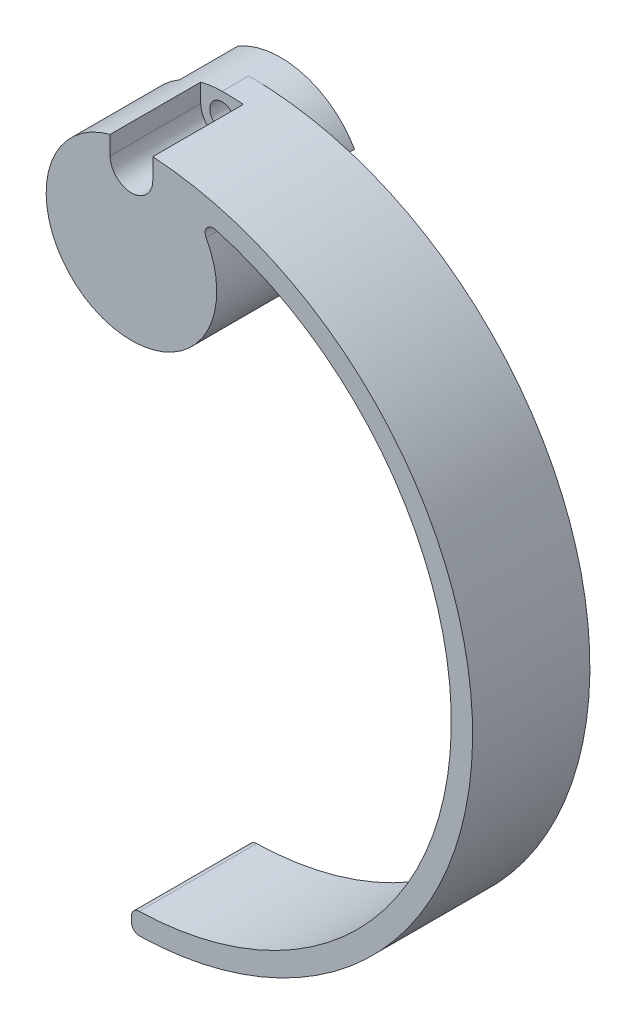
ISO-10303-21;
HEADER;
FILE_DESCRIPTION(('STEP AP214'),'2;1');
FILE_NAME('part.step','',(''),(''),'','','');
FILE_SCHEMA(('AUTOMOTIVE_DESIGN { 1 0 10303 214 1 1 1 1 }'));
ENDSEC;
DATA;
#1=APPLICATION_CONTEXT('core data for automotive mechanical design processes');
#2=APPLICATION_PROTOCOL_DEFINITION('international standard','automotive_design',2000,#1);
#3=PRODUCT_CONTEXT('',#1,'mechanical');
#4=PRODUCT('Part','Part','',(#3));
#5=PRODUCT_RELATED_PRODUCT_CATEGORY('part','',(#4));
#6=PRODUCT_DEFINITION_FORMATION('','',#4);
#7=PRODUCT_DEFINITION_CONTEXT('part definition',#1,'design');
#8=PRODUCT_DEFINITION('design','',#6,#7);
#9=PRODUCT_DEFINITION_SHAPE('','',#8);
#10=(LENGTH_UNIT() NAMED_UNIT(*) SI_UNIT(.MILLI.,.METRE.));
#11=(NAMED_UNIT(*) PLANE_ANGLE_UNIT() SI_UNIT($,.RADIAN.));
#12=(NAMED_UNIT(*) SI_UNIT($,.STERADIAN.) SOLID_ANGLE_UNIT());
#13=UNCERTAINTY_MEASURE_WITH_UNIT(LENGTH_MEASURE(1.E-05),#10,'distance_accuracy_value','');
#14=(GEOMETRIC_REPRESENTATION_CONTEXT(3) GLOBAL_UNCERTAINTY_ASSIGNED_CONTEXT((#13)) GLOBAL_UNIT_ASSIGNED_CONTEXT((#10,
#11,#12)) REPRESENTATION_CONTEXT('',''));
#15=CARTESIAN_POINT('',(0.,0.,0.));
#16=DIRECTION('',(0.,0.,1.));
#17=DIRECTION('',(1.,0.,0.));
#18=AXIS2_PLACEMENT_3D('',#15,#16,#17);
#19=CARTESIAN_POINT('',(0.,0.,11.));
#20=DIRECTION('',(0.,0.,-1.));
#21=DIRECTION('',(-1.,0.,0.));
#22=AXIS2_PLACEMENT_3D('',#19,#20,#21);
#23=CYLINDRICAL_SURFACE('',#22,8.);
#24=CARTESIAN_POINT('',(0.,0.,0.));
#25=DIRECTION('',(0.,0.,-1.));
#26=DIRECTION('',(-1.,0.,0.));
#27=AXIS2_PLACEMENT_3D('',#24,#25,#26);
#28=CIRCLE('',#27,8.);
#29=CARTESIAN_POINT('',(0.,8.,0.));
#30=VERTEX_POINT('',#29);
#31=CARTESIAN_POINT('',(6.92820323027549,4.00000000000003,0.));
#32=VERTEX_POINT('',#31);
#33=EDGE_CURVE('E368',#30,#32,#28,.T.);
#34=ORIENTED_EDGE('',*,*,#33,.T.);
#35=DIRECTION('',(0.,0.,-1.));
#36=VECTOR('',#35,1.);
#37=CARTESIAN_POINT('',(6.92820323027549,4.00000000000003,24.3826701223687));
#38=LINE('',#37,#36);
#39=CARTESIAN_POINT('',(6.92820323027549,4.00000000000003,-3.));
#40=VERTEX_POINT('',#39);
#41=EDGE_CURVE('E252',#32,#40,#38,.T.);
#42=ORIENTED_EDGE('',*,*,#41,.T.);
#43=CARTESIAN_POINT('',(0.,0.,-3.));
#44=DIRECTION('',(0.,0.,-1.));
#45=DIRECTION('',(-1.,0.,0.));
#46=AXIS2_PLACEMENT_3D('',#43,#44,#45);
#47=CIRCLE('',#46,8.);
#48=CARTESIAN_POINT('',(-4.00000000000001,6.92820323027551,-3.));
#49=VERTEX_POINT('',#48);
#50=EDGE_CURVE('E269',#49,#40,#47,.T.);
#51=ORIENTED_EDGE('',*,*,#50,.F.);
#52=DIRECTION('',(0.,0.,-1.));
#53=VECTOR('',#52,1.);
#54=CARTESIAN_POINT('',(-4.00000000000001,6.92820323027551,24.3826701223687));
#55=LINE('',#54,#53);
#56=CARTESIAN_POINT('',(-4.00000000000001,6.92820323027551,2.5));
#57=VERTEX_POINT('',#56);
#58=EDGE_CURVE('E296',#57,#49,#55,.T.);
#59=ORIENTED_EDGE('',*,*,#58,.F.);
#60=CARTESIAN_POINT('',(0.,0.,2.5));
#61=DIRECTION('',(0.,0.,-1.));
#62=DIRECTION('',(-1.,0.,0.));
#63=AXIS2_PLACEMENT_3D('',#60,#61,#62);
#64=CIRCLE('',#63,8.);
#65=CARTESIAN_POINT('',(-7.74596669241484,2.,2.5));
#66=VERTEX_POINT('',#65);
#67=EDGE_CURVE('E497',#57,#66,#64,.F.);
#68=ORIENTED_EDGE('',*,*,#67,.T.);
#69=DIRECTION('',(0.,0.,-1.));
#70=VECTOR('',#69,1.);
#71=CARTESIAN_POINT('',(-7.74596669241485,2.,11.));
#72=LINE('',#71,#70);
#73=CARTESIAN_POINT('',(-7.74596669241485,2.,5.));
#74=VERTEX_POINT('',#73);
#75=EDGE_CURVE('E407',#66,#74,#72,.F.);
#76=ORIENTED_EDGE('',*,*,#75,.T.);
#77=CARTESIAN_POINT('',(0.,0.,5.));
#78=DIRECTION('',(0.,0.,-1.));
#79=DIRECTION('',(-1.,0.,0.));
#80=AXIS2_PLACEMENT_3D('',#77,#78,#79);
#81=CIRCLE('',#80,8.00000000000001);
#82=CARTESIAN_POINT('',(-7.74596669241484,-2.,5.));
#83=VERTEX_POINT('',#82);
#84=EDGE_CURVE('E547',#74,#83,#81,.F.);
#85=ORIENTED_EDGE('',*,*,#84,.T.);
#86=DIRECTION('',(0.,0.,-1.));
#87=VECTOR('',#86,1.);
#88=CARTESIAN_POINT('',(-7.74596669241484,-2.,11.));
#89=LINE('',#88,#87);
#90=CARTESIAN_POINT('',(-7.74596669241483,-2.,2.5));
#91=VERTEX_POINT('',#90);
#92=EDGE_CURVE('E405',#83,#91,#89,.T.);
#93=ORIENTED_EDGE('',*,*,#92,.T.);
#94=CARTESIAN_POINT('',(-2.,-7.74596669241483,2.5));
#95=VERTEX_POINT('',#94);
#96=EDGE_CURVE('E499',#91,#95,#64,.F.);
#97=ORIENTED_EDGE('',*,*,#96,.T.);
#98=DIRECTION('',(0.,0.,-1.));
#99=VECTOR('',#98,1.);
#100=CARTESIAN_POINT('',(-2.,-7.74596669241484,11.));
#101=LINE('',#100,#99);
#102=CARTESIAN_POINT('',(-2.,-7.74596669241484,5.));
#103=VERTEX_POINT('',#102);
#104=EDGE_CURVE('E402',#95,#103,#101,.F.);
#105=ORIENTED_EDGE('',*,*,#104,.T.);
#106=CARTESIAN_POINT('',(2.,-7.74596669241483,5.));
#107=VERTEX_POINT('',#106);
#108=EDGE_CURVE('E545',#103,#107,#81,.F.);
#109=ORIENTED_EDGE('',*,*,#108,.T.);
#110=DIRECTION('',(0.,0.,-1.));
#111=VECTOR('',#110,1.);
#112=CARTESIAN_POINT('',(2.,-7.74596669241483,11.));
#113=LINE('',#112,#111);
#114=CARTESIAN_POINT('',(2.,-7.74596669241483,2.5));
#115=VERTEX_POINT('',#114);
#116=EDGE_CURVE('E400',#107,#115,#113,.T.);
#117=ORIENTED_EDGE('',*,*,#116,.T.);
#118=CARTESIAN_POINT('',(7.74596669241483,-2.,2.5));
#119=VERTEX_POINT('',#118);
#120=EDGE_CURVE('E495',#115,#119,#64,.F.);
#121=ORIENTED_EDGE('',*,*,#120,.T.);
#122=DIRECTION('',(0.,0.,-1.));
#123=VECTOR('',#122,1.);
#124=CARTESIAN_POINT('',(7.74596669241483,-2.,11.));
#125=LINE('',#124,#123);
#126=CARTESIAN_POINT('',(7.74596669241483,-2.,5.));
#127=VERTEX_POINT('',#126);
#128=EDGE_CURVE('E397',#119,#127,#125,.F.);
#129=ORIENTED_EDGE('',*,*,#128,.T.);
#130=CARTESIAN_POINT('',(7.74596669241483,2.,5.));
#131=VERTEX_POINT('',#130);
#132=EDGE_CURVE('E541',#127,#131,#81,.F.);
#133=ORIENTED_EDGE('',*,*,#132,.T.);
#134=DIRECTION('',(0.,0.,-1.));
#135=VECTOR('',#134,1.);
#136=CARTESIAN_POINT('',(7.74596669241483,2.,11.));
#137=LINE('',#136,#135);
#138=CARTESIAN_POINT('',(7.74596669241483,2.,2.5));
#139=VERTEX_POINT('',#138);
#140=EDGE_CURVE('E393',#131,#139,#137,.T.);
#141=ORIENTED_EDGE('',*,*,#140,.T.);
#142=CARTESIAN_POINT('',(7.00349119289008,3.86666666666667,2.5));
#143=VERTEX_POINT('',#142);
#144=EDGE_CURVE('E287',#139,#143,#64,.F.);
#145=ORIENTED_EDGE('',*,*,#144,.T.);
#146=DIRECTION('',(0.,0.,-1.));
#147=VECTOR('',#146,1.);
#148=CARTESIAN_POINT('',(7.00349119289008,3.86666666666667,11.));
#149=LINE('',#148,#147);
#150=CARTESIAN_POINT('',(7.00349119289008,3.86666666666667,11.));
#151=VERTEX_POINT('',#150);
#152=EDGE_CURVE('E423',#143,#151,#149,.F.);
#153=ORIENTED_EDGE('',*,*,#152,.T.);
#154=CARTESIAN_POINT('',(0.,0.,11.));
#155=DIRECTION('',(0.,0.,1.));
#156=DIRECTION('',(1.,0.,0.));
#157=AXIS2_PLACEMENT_3D('',#154,#155,#156);
#158=CIRCLE('',#157,8.);
#159=CARTESIAN_POINT('',(-2.,7.74596669241484,11.));
#160=VERTEX_POINT('',#159);
#161=EDGE_CURVE('E374',#160,#151,#158,.T.);
#162=ORIENTED_EDGE('',*,*,#161,.F.);
#163=DIRECTION('',(0.,0.,-1.));
#164=VECTOR('',#163,1.);
#165=CARTESIAN_POINT('',(-2.,7.74596669241484,11.));
#166=LINE('',#165,#164);
#167=CARTESIAN_POINT('',(-2.,7.74596669241484,2.5));
#168=VERTEX_POINT('',#167);
#169=EDGE_CURVE('E410',#160,#168,#166,.T.);
#170=ORIENTED_EDGE('',*,*,#169,.T.);
#171=CARTESIAN_POINT('',(0.,0.,2.5));
#172=DIRECTION('',(0.,0.,-1.));
#173=DIRECTION('',(-1.,0.,0.));
#174=AXIS2_PLACEMENT_3D('',#171,#172,#173);
#175=CIRCLE('',#174,8.);
#176=CARTESIAN_POINT('',(0.,8.,2.5));
#177=VERTEX_POINT('',#176);
#178=EDGE_CURVE('E359',#168,#177,#175,.T.);
#179=ORIENTED_EDGE('',*,*,#178,.T.);
#180=DIRECTION('',(0.,0.,-1.));
#181=VECTOR('',#180,1.);
#182=CARTESIAN_POINT('',(0.,8.,11.));
#183=LINE('',#182,#181);
#184=EDGE_CURVE('E384',#177,#30,#183,.T.);
#185=ORIENTED_EDGE('',*,*,#184,.T.);
#186=EDGE_LOOP('',(#34,#42,#51,#59,#68,#76,#85,#93,#97,#105,#109,#117,#121,#129,#133,#141,#145,
#153,#162,#170,#179,#185));
#187=FACE_BOUND('',#186,.T.);
#188=ADVANCED_FACE('F35',(#187),#23,.T.);
#189=CARTESIAN_POINT('',(0.,-24.,11.));
#190=DIRECTION('',(0.,0.,-1.));
#191=DIRECTION('',(-1.,0.,0.));
#192=AXIS2_PLACEMENT_3D('',#189,#190,#191);
#193=PLANE('',#192);
#194=DIRECTION('',(0.,-1.,0.));
#195=VECTOR('',#194,1.);
#196=CARTESIAN_POINT('',(0.,-56.,11.));
#197=LINE('',#196,#195);
#198=CARTESIAN_POINT('',(0.,-54.7408522978788,11.));
#199=VERTEX_POINT('',#198);
#200=CARTESIAN_POINT('',(0.,-55.2409987036266,11.));
#201=VERTEX_POINT('',#200);
#202=EDGE_CURVE('E381',#199,#201,#197,.T.);
#203=ORIENTED_EDGE('',*,*,#202,.T.);
#204=CARTESIAN_POINT('',(0.75,-55.2409987036266,11.));
#205=DIRECTION('',(0.,0.,-1.));
#206=DIRECTION('',(-1.,0.,0.));
#207=AXIS2_PLACEMENT_3D('',#204,#205,#206);
#208=CIRCLE('',#207,0.75);
#209=CARTESIAN_POINT('',(0.768,-55.9907826725137,11.));
#210=VERTEX_POINT('',#209);
#211=EDGE_CURVE('E439',#201,#210,#208,.F.);
#212=ORIENTED_EDGE('',*,*,#211,.T.);
#213=CARTESIAN_POINT('',(0.,-24.,11.));
#214=DIRECTION('',(0.,0.,1.));
#215=DIRECTION('',(-1.,0.,0.));
#216=AXIS2_PLACEMENT_3D('',#213,#214,#215);
#217=CIRCLE('',#216,32.);
#218=CARTESIAN_POINT('',(2.,7.93743884534262,11.));
#219=VERTEX_POINT('',#218);
#220=EDGE_CURVE('E372',#210,#219,#217,.T.);
#221=ORIENTED_EDGE('',*,*,#220,.T.);
#222=DIRECTION('',(0.,1.,0.));
#223=VECTOR('',#222,1.);
#224=CARTESIAN_POINT('',(2.,8.,11.));
#225=LINE('',#224,#223);
#226=CARTESIAN_POINT('',(2.,6.,11.));
#227=VERTEX_POINT('',#226);
#228=EDGE_CURVE('E305',#227,#219,#225,.T.);
#229=ORIENTED_EDGE('',*,*,#228,.F.);
#230=CARTESIAN_POINT('',(0.,6.,11.));
#231=DIRECTION('',(0.,0.,1.));
#232=DIRECTION('',(-1.,0.,0.));
#233=AXIS2_PLACEMENT_3D('',#230,#231,#232);
#234=CIRCLE('',#233,2.);
#235=CARTESIAN_POINT('',(-2.,6.,11.));
#236=VERTEX_POINT('',#235);
#237=EDGE_CURVE('E308',#236,#227,#234,.T.);
#238=ORIENTED_EDGE('',*,*,#237,.F.);
#239=DIRECTION('',(0.,-1.,0.));
#240=VECTOR('',#239,1.);
#241=CARTESIAN_POINT('',(-2.,6.,11.));
#242=LINE('',#241,#240);
#243=EDGE_CURVE('E302',#160,#236,#242,.T.);
#244=ORIENTED_EDGE('',*,*,#243,.F.);
#245=ORIENTED_EDGE('',*,*,#161,.T.);
#246=CARTESIAN_POINT('',(7.66006849222352,4.22916666666667,11.));
#247=DIRECTION('',(0.,0.,-1.));
#248=DIRECTION('',(-1.,0.,0.));
#249=AXIS2_PLACEMENT_3D('',#246,#247,#248);
#250=CIRCLE('',#249,0.75);
#251=CARTESIAN_POINT('',(7.85648050484463,4.95299145299145,11.));
#252=VERTEX_POINT('',#251);
#253=EDGE_CURVE('E43',#151,#252,#250,.T.);
#254=ORIENTED_EDGE('',*,*,#253,.T.);
#255=CARTESIAN_POINT('',(0.,-24.,11.));
#256=DIRECTION('',(0.,0.,-1.));
#257=DIRECTION('',(-1.,0.,0.));
#258=AXIS2_PLACEMENT_3D('',#255,#256,#257);
#259=CIRCLE('',#258,30.);
#260=CARTESIAN_POINT('',(0.731707317073171,-53.9910754125647,11.));
#261=VERTEX_POINT('',#260);
#262=EDGE_CURVE('E378',#252,#261,#259,.T.);
#263=ORIENTED_EDGE('',*,*,#262,.T.);
#264=CARTESIAN_POINT('',(0.75,-54.7408522978788,11.));
#265=DIRECTION('',(0.,0.,-1.));
#266=DIRECTION('',(-1.,0.,0.));
#267=AXIS2_PLACEMENT_3D('',#264,#265,#266);
#268=CIRCLE('',#267,0.75);
#269=EDGE_CURVE('E437',#261,#199,#268,.F.);
#270=ORIENTED_EDGE('',*,*,#269,.T.);
#271=EDGE_LOOP('',(#203,#212,#221,#229,#238,#244,#245,#254,#263,#270));
#272=FACE_BOUND('',#271,.T.);
#273=ADVANCED_FACE('F448',(#272),#193,.F.);
#274=CARTESIAN_POINT('',(0.,-24.,0.));
#275=DIRECTION('',(0.,0.,-1.));
#276=DIRECTION('',(-1.,0.,0.));
#277=AXIS2_PLACEMENT_3D('',#274,#275,#276);
#278=PLANE('',#277);
#279=CARTESIAN_POINT('',(0.,-24.,0.));
#280=DIRECTION('',(0.,0.,1.));
#281=DIRECTION('',(-1.,0.,0.));
#282=AXIS2_PLACEMENT_3D('',#279,#280,#281);
#283=CIRCLE('',#282,32.);
#284=CARTESIAN_POINT('',(0.768,-55.9907826725137,0.));
#285=VERTEX_POINT('',#284);
#286=EDGE_CURVE('E370',#285,#30,#283,.T.);
#287=ORIENTED_EDGE('',*,*,#286,.F.);
#288=CARTESIAN_POINT('',(0.75,-55.2409987036266,0.));
#289=DIRECTION('',(0.,0.,-1.));
#290=DIRECTION('',(-1.,0.,0.));
#291=AXIS2_PLACEMENT_3D('',#288,#289,#290);
#292=CIRCLE('',#291,0.75);
#293=CARTESIAN_POINT('',(0.,-55.2409987036266,0.));
#294=VERTEX_POINT('',#293);
#295=EDGE_CURVE('E430',#285,#294,#292,.T.);
#296=ORIENTED_EDGE('',*,*,#295,.T.);
#297=DIRECTION('',(0.,-1.,0.));
#298=VECTOR('',#297,1.);
#299=CARTESIAN_POINT('',(0.,-56.,0.));
#300=LINE('',#299,#298);
#301=CARTESIAN_POINT('',(0.,-54.7408522978788,0.));
#302=VERTEX_POINT('',#301);
#303=EDGE_CURVE('E375',#302,#294,#300,.T.);
#304=ORIENTED_EDGE('',*,*,#303,.F.);
#305=CARTESIAN_POINT('',(0.75,-54.7408522978788,0.));
#306=DIRECTION('',(0.,0.,-1.));
#307=DIRECTION('',(-1.,0.,0.));
#308=AXIS2_PLACEMENT_3D('',#305,#306,#307);
#309=CIRCLE('',#308,0.75);
#310=CARTESIAN_POINT('',(0.731707317073171,-53.9910754125647,0.));
#311=VERTEX_POINT('',#310);
#312=EDGE_CURVE('E428',#302,#311,#309,.T.);
#313=ORIENTED_EDGE('',*,*,#312,.T.);
#314=CARTESIAN_POINT('',(0.,-24.,0.));
#315=DIRECTION('',(0.,0.,-1.));
#316=DIRECTION('',(-1.,0.,0.));
#317=AXIS2_PLACEMENT_3D('',#314,#315,#316);
#318=CIRCLE('',#317,30.);
#319=CARTESIAN_POINT('',(7.85648050484463,4.95299145299145,0.));
#320=VERTEX_POINT('',#319);
#321=EDGE_CURVE('E386',#320,#311,#318,.T.);
#322=ORIENTED_EDGE('',*,*,#321,.F.);
#323=CARTESIAN_POINT('',(7.66006849222352,4.22916666666667,0.));
#324=DIRECTION('',(0.,0.,-1.));
#325=DIRECTION('',(-1.,0.,0.));
#326=AXIS2_PLACEMENT_3D('',#323,#324,#325);
#327=CIRCLE('',#326,0.75);
#328=CARTESIAN_POINT('',(6.94321441395881,4.00866671094045,0.));
#329=VERTEX_POINT('',#328);
#330=EDGE_CURVE('E50',#320,#329,#327,.F.);
#331=ORIENTED_EDGE('',*,*,#330,.T.);
#332=DIRECTION('',(0.866025403784436,0.500000000000004,0.));
#333=VECTOR('',#332,1.);
#334=CARTESIAN_POINT('',(-10.3923048454133,-6.0000000000001,0.));
#335=LINE('',#334,#333);
#336=EDGE_CURVE('E12',#32,#329,#335,.T.);
#337=ORIENTED_EDGE('',*,*,#336,.F.);
#338=ORIENTED_EDGE('',*,*,#33,.F.);
#339=EDGE_LOOP('',(#287,#296,#304,#313,#322,#331,#337,#338));
#340=FACE_BOUND('',#339,.T.);
#341=ADVANCED_FACE('F463',(#340),#278,.T.);
#342=CARTESIAN_POINT('',(0.,-24.,11.));
#343=DIRECTION('',(0.,0.,-1.));
#344=DIRECTION('',(-1.,0.,0.));
#345=AXIS2_PLACEMENT_3D('',#342,#343,#344);
#346=CYLINDRICAL_SURFACE('',#345,32.);
#347=ORIENTED_EDGE('',*,*,#220,.F.);
#348=DIRECTION('',(0.,0.,-1.));
#349=VECTOR('',#348,1.);
#350=CARTESIAN_POINT('',(0.768,-55.9907826725137,11.));
#351=LINE('',#350,#349);
#352=EDGE_CURVE('E425',#210,#285,#351,.T.);
#353=ORIENTED_EDGE('',*,*,#352,.T.);
#354=ORIENTED_EDGE('',*,*,#286,.T.);
#355=ORIENTED_EDGE('',*,*,#184,.F.);
#356=CARTESIAN_POINT('',(0.,-24.,2.5));
#357=DIRECTION('',(0.,0.,-1.));
#358=DIRECTION('',(-1.,0.,0.));
#359=AXIS2_PLACEMENT_3D('',#356,#357,#358);
#360=CIRCLE('',#359,32.);
#361=CARTESIAN_POINT('',(2.,7.93743884534262,2.5));
#362=VERTEX_POINT('',#361);
#363=EDGE_CURVE('E362',#177,#362,#360,.T.);
#364=ORIENTED_EDGE('',*,*,#363,.T.);
#365=DIRECTION('',(0.,0.,-1.));
#366=VECTOR('',#365,1.);
#367=CARTESIAN_POINT('',(2.,7.93743884534262,11.));
#368=LINE('',#367,#366);
#369=EDGE_CURVE('E413',#362,#219,#368,.F.);
#370=ORIENTED_EDGE('',*,*,#369,.T.);
#371=EDGE_LOOP('',(#347,#353,#354,#355,#364,#370));
#372=FACE_BOUND('',#371,.T.);
#373=ADVANCED_FACE('F469',(#372),#346,.T.);
#374=CARTESIAN_POINT('',(0.,-24.,11.));
#375=DIRECTION('',(0.,0.,-1.));
#376=DIRECTION('',(-1.,0.,0.));
#377=AXIS2_PLACEMENT_3D('',#374,#375,#376);
#378=CYLINDRICAL_SURFACE('',#377,30.);
#379=ORIENTED_EDGE('',*,*,#262,.F.);
#380=DIRECTION('',(0.,0.,-1.));
#381=VECTOR('',#380,1.);
#382=CARTESIAN_POINT('',(7.85648050484463,4.95299145299145,11.));
#383=LINE('',#382,#381);
#384=EDGE_CURVE('E420',#252,#320,#383,.T.);
#385=ORIENTED_EDGE('',*,*,#384,.T.);
#386=ORIENTED_EDGE('',*,*,#321,.T.);
#387=DIRECTION('',(0.,0.,-1.));
#388=VECTOR('',#387,1.);
#389=CARTESIAN_POINT('',(0.731707317073171,-53.9910754125647,11.));
#390=LINE('',#389,#388);
#391=EDGE_CURVE('E418',#311,#261,#390,.F.);
#392=ORIENTED_EDGE('',*,*,#391,.T.);
#393=EDGE_LOOP('',(#379,#385,#386,#392));
#394=FACE_BOUND('',#393,.T.);
#395=ADVANCED_FACE('F456',(#394),#378,.F.);
#396=CARTESIAN_POINT('',(0.,-56.,11.));
#397=DIRECTION('',(1.,0.,0.));
#398=DIRECTION('',(0.,0.,-1.));
#399=AXIS2_PLACEMENT_3D('',#396,#397,#398);
#400=PLANE('',#399);
#401=ORIENTED_EDGE('',*,*,#303,.T.);
#402=DIRECTION('',(0.,0.,-1.));
#403=VECTOR('',#402,1.);
#404=CARTESIAN_POINT('',(0.,-55.2409987036266,11.));
#405=LINE('',#404,#403);
#406=EDGE_CURVE('E435',#294,#201,#405,.F.);
#407=ORIENTED_EDGE('',*,*,#406,.T.);
#408=ORIENTED_EDGE('',*,*,#202,.F.);
#409=DIRECTION('',(0.,0.,-1.));
#410=VECTOR('',#409,1.);
#411=CARTESIAN_POINT('',(0.,-54.7408522978788,11.));
#412=LINE('',#411,#410);
#413=EDGE_CURVE('E432',#199,#302,#412,.T.);
#414=ORIENTED_EDGE('',*,*,#413,.T.);
#415=EDGE_LOOP('',(#401,#407,#408,#414));
#416=FACE_BOUND('',#415,.T.);
#417=ADVANCED_FACE('F477',(#416),#400,.F.);
#418=CARTESIAN_POINT('',(0.,6.,11.));
#419=DIRECTION('',(0.,0.,-1.));
#420=DIRECTION('',(-1.,0.,0.));
#421=AXIS2_PLACEMENT_3D('',#418,#419,#420);
#422=CYLINDRICAL_SURFACE('',#421,1.15);
#423=CARTESIAN_POINT('',(0.,6.,2.5));
#424=DIRECTION('',(0.,0.,-1.));
#425=DIRECTION('',(-1.,0.,0.));
#426=AXIS2_PLACEMENT_3D('',#423,#424,#425);
#427=CIRCLE('',#426,1.15);
#428=CARTESIAN_POINT('',(-1.15,6.,2.5));
#429=VERTEX_POINT('',#428);
#430=EDGE_CURVE('E324',#429,#429,#427,.T.);
#431=ORIENTED_EDGE('',*,*,#430,.F.);
#432=EDGE_LOOP('',(#431));
#433=FACE_BOUND('',#432,.T.);
#434=CARTESIAN_POINT('',(0.,6.,-3.));
#435=DIRECTION('',(0.,0.,-1.));
#436=DIRECTION('',(-1.,0.,0.));
#437=AXIS2_PLACEMENT_3D('',#434,#435,#436);
#438=CIRCLE('',#437,1.15);
#439=CARTESIAN_POINT('',(-1.15,6.,-3.));
#440=VERTEX_POINT('',#439);
#441=EDGE_CURVE('E365',#440,#440,#438,.T.);
#442=ORIENTED_EDGE('',*,*,#441,.T.);
#443=EDGE_LOOP('',(#442));
#444=FACE_BOUND('',#443,.T.);
#445=ADVANCED_FACE('F641',(#433,#444),#422,.F.);
#446=CARTESIAN_POINT('',(0.,0.,-3.));
#447=DIRECTION('',(0.,0.,-1.));
#448=DIRECTION('',(-1.,0.,0.));
#449=AXIS2_PLACEMENT_3D('',#446,#447,#448);
#450=PLANE('',#449);
#451=DIRECTION('',(0.500000000000001,-0.866025403784438,0.));
#452=VECTOR('',#451,1.);
#453=CARTESIAN_POINT('',(-4.00000000000001,6.92820323027551,-3.));
#454=LINE('',#453,#452);
#455=CARTESIAN_POINT('',(-1.975,3.42080034494853,-3.));
#456=VERTEX_POINT('',#455);
#457=EDGE_CURVE('E270',#49,#456,#454,.T.);
#458=ORIENTED_EDGE('',*,*,#457,.F.);
#459=ORIENTED_EDGE('',*,*,#50,.T.);
#460=DIRECTION('',(0.866025403784436,0.500000000000004,0.));
#461=VECTOR('',#460,1.);
#462=CARTESIAN_POINT('',(3.42080034494852,1.97500000000002,-3.));
#463=LINE('',#462,#461);
#464=CARTESIAN_POINT('',(3.42080034494852,1.97500000000002,-3.));
#465=VERTEX_POINT('',#464);
#466=EDGE_CURVE('E249',#465,#40,#463,.T.);
#467=ORIENTED_EDGE('',*,*,#466,.F.);
#468=CARTESIAN_POINT('',(0.,0.,-3.));
#469=DIRECTION('',(0.,0.,1.));
#470=DIRECTION('',(-1.,0.,0.));
#471=AXIS2_PLACEMENT_3D('',#468,#469,#470);
#472=CIRCLE('',#471,3.95);
#473=CARTESIAN_POINT('',(-2.01721779919058,-3.39607602250431,-3.));
#474=VERTEX_POINT('',#473);
#475=EDGE_CURVE('E256',#474,#465,#472,.T.);
#476=ORIENTED_EDGE('',*,*,#475,.F.);
#477=DIRECTION('',(0.707106781186551,0.707106781186544,0.));
#478=VECTOR('',#477,1.);
#479=CARTESIAN_POINT('',(-2.01721779919058,-3.39607602250431,-3.));
#480=LINE('',#479,#478);
#481=CARTESIAN_POINT('',(-2.72432458037713,-4.10318280369086,-3.));
#482=VERTEX_POINT('',#481);
#483=EDGE_CURVE('E253',#482,#474,#480,.T.);
#484=ORIENTED_EDGE('',*,*,#483,.F.);
#485=DIRECTION('',(0.707106781186544,-0.707106781186551,0.));
#486=VECTOR('',#485,1.);
#487=CARTESIAN_POINT('',(-2.72432458037713,-4.10318280369086,-3.));
#488=LINE('',#487,#486);
#489=CARTESIAN_POINT('',(-4.10318280369089,-2.72432458037708,-3.));
#490=VERTEX_POINT('',#489);
#491=EDGE_CURVE('E282',#490,#482,#488,.T.);
#492=ORIENTED_EDGE('',*,*,#491,.F.);
#493=DIRECTION('',(-0.707106781186551,-0.707106781186544,0.));
#494=VECTOR('',#493,1.);
#495=CARTESIAN_POINT('',(-4.10318280369089,-2.72432458037708,-3.));
#496=LINE('',#495,#494);
#497=CARTESIAN_POINT('',(-3.39607602250434,-2.01721779919054,-3.));
#498=VERTEX_POINT('',#497);
#499=EDGE_CURVE('E279',#498,#490,#496,.T.);
#500=ORIENTED_EDGE('',*,*,#499,.F.);
#501=CARTESIAN_POINT('',(0.,0.,-3.));
#502=DIRECTION('',(0.,0.,1.));
#503=DIRECTION('',(-1.,0.,0.));
#504=AXIS2_PLACEMENT_3D('',#501,#502,#503);
#505=CIRCLE('',#504,3.95);
#506=EDGE_CURVE('E273',#456,#498,#505,.T.);
#507=ORIENTED_EDGE('',*,*,#506,.F.);
#508=EDGE_LOOP('',(#458,#459,#467,#476,#484,#492,#500,#507));
#509=FACE_BOUND('',#508,.T.);
#510=ORIENTED_EDGE('',*,*,#441,.F.);
#511=EDGE_LOOP('',(#510));
#512=FACE_BOUND('',#511,.T.);
#513=ADVANCED_FACE('F266',(#509,#512),#450,.T.);
#514=CARTESIAN_POINT('',(8.,-2.,-8.65685424949238));
#515=DIRECTION('',(0.,-1.,0.));
#516=DIRECTION('',(1.,0.,0.));
#517=AXIS2_PLACEMENT_3D('',#514,#515,#516);
#518=PLANE('',#517);
#519=DIRECTION('',(0.,0.,1.));
#520=VECTOR('',#519,1.);
#521=CARTESIAN_POINT('',(6.,-2.,-8.65685424949238));
#522=LINE('',#521,#520);
#523=CARTESIAN_POINT('',(6.,-2.,2.5));
#524=VERTEX_POINT('',#523);
#525=CARTESIAN_POINT('',(6.,-2.,5.));
#526=VERTEX_POINT('',#525);
#527=EDGE_CURVE('E340',#524,#526,#522,.T.);
#528=ORIENTED_EDGE('',*,*,#527,.T.);
#529=DIRECTION('',(1.,0.,0.));
#530=VECTOR('',#529,1.);
#531=CARTESIAN_POINT('',(8.,-2.,5.));
#532=LINE('',#531,#530);
#533=EDGE_CURVE('E263',#526,#127,#532,.T.);
#534=ORIENTED_EDGE('',*,*,#533,.T.);
#535=ORIENTED_EDGE('',*,*,#128,.F.);
#536=DIRECTION('',(1.,0.,0.));
#537=VECTOR('',#536,1.);
#538=CARTESIAN_POINT('',(8.,-2.,2.5));
#539=LINE('',#538,#537);
#540=EDGE_CURVE('E300',#524,#119,#539,.T.);
#541=ORIENTED_EDGE('',*,*,#540,.F.);
#542=EDGE_LOOP('',(#528,#534,#535,#541));
#543=FACE_BOUND('',#542,.T.);
#544=ADVANCED_FACE('F535',(#543),#518,.F.);
#545=CARTESIAN_POINT('',(6.,2.,-8.65685424949238));
#546=DIRECTION('',(0.,1.,0.));
#547=DIRECTION('',(-1.,0.,0.));
#548=AXIS2_PLACEMENT_3D('',#545,#546,#547);
#549=PLANE('',#548);
#550=ORIENTED_EDGE('',*,*,#140,.F.);
#551=DIRECTION('',(-1.,0.,0.));
#552=VECTOR('',#551,1.);
#553=CARTESIAN_POINT('',(6.,2.,5.));
#554=LINE('',#553,#552);
#555=CARTESIAN_POINT('',(6.,2.,5.));
#556=VERTEX_POINT('',#555);
#557=EDGE_CURVE('E526',#131,#556,#554,.T.);
#558=ORIENTED_EDGE('',*,*,#557,.T.);
#559=DIRECTION('',(0.,0.,1.));
#560=VECTOR('',#559,1.);
#561=CARTESIAN_POINT('',(6.,2.,-8.65685424949238));
#562=LINE('',#561,#560);
#563=CARTESIAN_POINT('',(6.,2.,2.5));
#564=VERTEX_POINT('',#563);
#565=EDGE_CURVE('E353',#564,#556,#562,.T.);
#566=ORIENTED_EDGE('',*,*,#565,.F.);
#567=DIRECTION('',(-1.,0.,0.));
#568=VECTOR('',#567,1.);
#569=CARTESIAN_POINT('',(6.,2.,2.5));
#570=LINE('',#569,#568);
#571=EDGE_CURVE('E350',#139,#564,#570,.T.);
#572=ORIENTED_EDGE('',*,*,#571,.F.);
#573=EDGE_LOOP('',(#550,#558,#566,#572));
#574=FACE_BOUND('',#573,.T.);
#575=ADVANCED_FACE('F749',(#574),#549,.F.);
#576=CARTESIAN_POINT('',(6.,0.,-8.65685424949238));
#577=DIRECTION('',(0.,0.,1.));
#578=DIRECTION('',(1.,0.,0.));
#579=AXIS2_PLACEMENT_3D('',#576,#577,#578);
#580=CYLINDRICAL_SURFACE('',#579,2.);
#581=ORIENTED_EDGE('',*,*,#565,.T.);
#582=CARTESIAN_POINT('',(6.,0.,5.));
#583=DIRECTION('',(0.,0.,-1.));
#584=DIRECTION('',(-1.,0.,0.));
#585=AXIS2_PLACEMENT_3D('',#582,#583,#584);
#586=CIRCLE('',#585,2.);
#587=EDGE_CURVE('E523',#556,#526,#586,.F.);
#588=ORIENTED_EDGE('',*,*,#587,.T.);
#589=ORIENTED_EDGE('',*,*,#527,.F.);
#590=CARTESIAN_POINT('',(6.,0.,2.5));
#591=DIRECTION('',(0.,0.,-1.));
#592=DIRECTION('',(-1.,0.,0.));
#593=AXIS2_PLACEMENT_3D('',#590,#591,#592);
#594=CIRCLE('',#593,2.);
#595=EDGE_CURVE('E351',#564,#524,#594,.F.);
#596=ORIENTED_EDGE('',*,*,#595,.F.);
#597=EDGE_LOOP('',(#581,#588,#589,#596));
#598=FACE_BOUND('',#597,.T.);
#599=ADVANCED_FACE('F574',(#598),#580,.F.);
#600=CARTESIAN_POINT('',(-2.,-8.,-8.65685424949238));
#601=DIRECTION('',(-1.,0.,0.));
#602=DIRECTION('',(0.,-1.,0.));
#603=AXIS2_PLACEMENT_3D('',#600,#601,#602);
#604=PLANE('',#603);
#605=DIRECTION('',(0.,0.,1.));
#606=VECTOR('',#605,1.);
#607=CARTESIAN_POINT('',(-2.,-6.,-8.65685424949238));
#608=LINE('',#607,#606);
#609=CARTESIAN_POINT('',(-2.,-6.,2.5));
#610=VERTEX_POINT('',#609);
#611=CARTESIAN_POINT('',(-2.,-6.,5.));
#612=VERTEX_POINT('',#611);
#613=EDGE_CURVE('E328',#610,#612,#608,.T.);
#614=ORIENTED_EDGE('',*,*,#613,.T.);
#615=DIRECTION('',(0.,-1.,0.));
#616=VECTOR('',#615,1.);
#617=CARTESIAN_POINT('',(-2.,-8.,5.));
#618=LINE('',#617,#616);
#619=EDGE_CURVE('E520',#612,#103,#618,.T.);
#620=ORIENTED_EDGE('',*,*,#619,.T.);
#621=ORIENTED_EDGE('',*,*,#104,.F.);
#622=DIRECTION('',(0.,-1.,0.));
#623=VECTOR('',#622,1.);
#624=CARTESIAN_POINT('',(-2.,-8.,2.5));
#625=LINE('',#624,#623);
#626=EDGE_CURVE('E337',#610,#95,#625,.T.);
#627=ORIENTED_EDGE('',*,*,#626,.F.);
#628=EDGE_LOOP('',(#614,#620,#621,#627));
#629=FACE_BOUND('',#628,.T.);
#630=ADVANCED_FACE('F517',(#629),#604,.F.);
#631=CARTESIAN_POINT('',(2.,-6.,-8.65685424949238));
#632=DIRECTION('',(1.,0.,0.));
#633=DIRECTION('',(0.,1.,0.));
#634=AXIS2_PLACEMENT_3D('',#631,#632,#633);
#635=PLANE('',#634);
#636=ORIENTED_EDGE('',*,*,#116,.F.);
#637=DIRECTION('',(0.,1.,0.));
#638=VECTOR('',#637,1.);
#639=CARTESIAN_POINT('',(2.,-6.,5.));
#640=LINE('',#639,#638);
#641=CARTESIAN_POINT('',(2.,-6.,5.));
#642=VERTEX_POINT('',#641);
#643=EDGE_CURVE('E524',#107,#642,#640,.T.);
#644=ORIENTED_EDGE('',*,*,#643,.T.);
#645=DIRECTION('',(0.,0.,1.));
#646=VECTOR('',#645,1.);
#647=CARTESIAN_POINT('',(2.,-6.,-8.65685424949238));
#648=LINE('',#647,#646);
#649=CARTESIAN_POINT('',(2.,-6.,2.5));
#650=VERTEX_POINT('',#649);
#651=EDGE_CURVE('E343',#650,#642,#648,.T.);
#652=ORIENTED_EDGE('',*,*,#651,.F.);
#653=DIRECTION('',(0.,1.,0.));
#654=VECTOR('',#653,1.);
#655=CARTESIAN_POINT('',(2.,-6.,2.5));
#656=LINE('',#655,#654);
#657=EDGE_CURVE('E339',#115,#650,#656,.T.);
#658=ORIENTED_EDGE('',*,*,#657,.F.);
#659=EDGE_LOOP('',(#636,#644,#652,#658));
#660=FACE_BOUND('',#659,.T.);
#661=ADVANCED_FACE('F565',(#660),#635,.F.);
#662=CARTESIAN_POINT('',(0.,-6.,-8.65685424949238));
#663=DIRECTION('',(0.,0.,1.));
#664=DIRECTION('',(1.,0.,0.));
#665=AXIS2_PLACEMENT_3D('',#662,#663,#664);
#666=CYLINDRICAL_SURFACE('',#665,2.);
#667=ORIENTED_EDGE('',*,*,#651,.T.);
#668=CARTESIAN_POINT('',(0.,-6.,5.));
#669=DIRECTION('',(0.,0.,-1.));
#670=DIRECTION('',(-1.,0.,0.));
#671=AXIS2_PLACEMENT_3D('',#668,#669,#670);
#672=CIRCLE('',#671,2.);
#673=EDGE_CURVE('E528',#642,#612,#672,.F.);
#674=ORIENTED_EDGE('',*,*,#673,.T.);
#675=ORIENTED_EDGE('',*,*,#613,.F.);
#676=CARTESIAN_POINT('',(0.,-6.,2.5));
#677=DIRECTION('',(0.,0.,-1.));
#678=DIRECTION('',(-1.,0.,0.));
#679=AXIS2_PLACEMENT_3D('',#676,#677,#678);
#680=CIRCLE('',#679,2.);
#681=EDGE_CURVE('E341',#650,#610,#680,.F.);
#682=ORIENTED_EDGE('',*,*,#681,.F.);
#683=EDGE_LOOP('',(#667,#674,#675,#682));
#684=FACE_BOUND('',#683,.T.);
#685=ADVANCED_FACE('F557',(#684),#666,.F.);
#686=CARTESIAN_POINT('',(-8.,2.,-8.65685424949238));
#687=DIRECTION('',(0.,1.,0.));
#688=DIRECTION('',(0.,0.,1.));
#689=AXIS2_PLACEMENT_3D('',#686,#687,#688);
#690=PLANE('',#689);
#691=DIRECTION('',(0.,0.,1.));
#692=VECTOR('',#691,1.);
#693=CARTESIAN_POINT('',(-6.,2.,-8.65685424949238));
#694=LINE('',#693,#692);
#695=CARTESIAN_POINT('',(-6.,2.,2.5));
#696=VERTEX_POINT('',#695);
#697=CARTESIAN_POINT('',(-6.,2.,5.));
#698=VERTEX_POINT('',#697);
#699=EDGE_CURVE('E311',#696,#698,#694,.T.);
#700=ORIENTED_EDGE('',*,*,#699,.T.);
#701=DIRECTION('',(-1.,0.,0.));
#702=VECTOR('',#701,1.);
#703=CARTESIAN_POINT('',(-8.,2.,5.));
#704=LINE('',#703,#702);
#705=EDGE_CURVE('E551',#698,#74,#704,.T.);
#706=ORIENTED_EDGE('',*,*,#705,.T.);
#707=ORIENTED_EDGE('',*,*,#75,.F.);
#708=DIRECTION('',(-1.,0.,0.));
#709=VECTOR('',#708,1.);
#710=CARTESIAN_POINT('',(-8.,2.,2.5));
#711=LINE('',#710,#709);
#712=EDGE_CURVE('E325',#696,#66,#711,.T.);
#713=ORIENTED_EDGE('',*,*,#712,.F.);
#714=EDGE_LOOP('',(#700,#706,#707,#713));
#715=FACE_BOUND('',#714,.T.);
#716=ADVANCED_FACE('F572',(#715),#690,.F.);
#717=CARTESIAN_POINT('',(-6.,-2.,-8.65685424949238));
#718=DIRECTION('',(0.,-1.,0.));
#719=DIRECTION('',(0.,0.,-1.));
#720=AXIS2_PLACEMENT_3D('',#717,#718,#719);
#721=PLANE('',#720);
#722=ORIENTED_EDGE('',*,*,#92,.F.);
#723=DIRECTION('',(1.,0.,0.));
#724=VECTOR('',#723,1.);
#725=CARTESIAN_POINT('',(-6.,-2.,5.));
#726=LINE('',#725,#724);
#727=CARTESIAN_POINT('',(-6.,-2.,5.));
#728=VERTEX_POINT('',#727);
#729=EDGE_CURVE('E549',#83,#728,#726,.T.);
#730=ORIENTED_EDGE('',*,*,#729,.T.);
#731=DIRECTION('',(0.,0.,1.));
#732=VECTOR('',#731,1.);
#733=CARTESIAN_POINT('',(-6.,-2.,-8.65685424949238));
#734=LINE('',#733,#732);
#735=CARTESIAN_POINT('',(-6.,-2.,2.5));
#736=VERTEX_POINT('',#735);
#737=EDGE_CURVE('E331',#736,#728,#734,.T.);
#738=ORIENTED_EDGE('',*,*,#737,.F.);
#739=DIRECTION('',(1.,0.,0.));
#740=VECTOR('',#739,1.);
#741=CARTESIAN_POINT('',(-6.,-2.,2.5));
#742=LINE('',#741,#740);
#743=EDGE_CURVE('E327',#91,#736,#742,.T.);
#744=ORIENTED_EDGE('',*,*,#743,.F.);
#745=EDGE_LOOP('',(#722,#730,#738,#744));
#746=FACE_BOUND('',#745,.T.);
#747=ADVANCED_FACE('F704',(#746),#721,.F.);
#748=CARTESIAN_POINT('',(-6.,0.,-8.65685424949238));
#749=DIRECTION('',(0.,0.,1.));
#750=DIRECTION('',(1.,0.,0.));
#751=AXIS2_PLACEMENT_3D('',#748,#749,#750);
#752=CYLINDRICAL_SURFACE('',#751,2.);
#753=ORIENTED_EDGE('',*,*,#737,.T.);
#754=CARTESIAN_POINT('',(-6.,0.,5.));
#755=DIRECTION('',(0.,0.,-1.));
#756=DIRECTION('',(-1.,0.,0.));
#757=AXIS2_PLACEMENT_3D('',#754,#755,#756);
#758=CIRCLE('',#757,2.);
#759=EDGE_CURVE('E416',#728,#698,#758,.F.);
#760=ORIENTED_EDGE('',*,*,#759,.T.);
#761=ORIENTED_EDGE('',*,*,#699,.F.);
#762=CARTESIAN_POINT('',(-6.,0.,2.5));
#763=DIRECTION('',(0.,0.,-1.));
#764=DIRECTION('',(-1.,0.,0.));
#765=AXIS2_PLACEMENT_3D('',#762,#763,#764);
#766=CIRCLE('',#765,2.);
#767=EDGE_CURVE('E329',#736,#696,#766,.F.);
#768=ORIENTED_EDGE('',*,*,#767,.F.);
#769=EDGE_LOOP('',(#753,#760,#761,#768));
#770=FACE_BOUND('',#769,.T.);
#771=ADVANCED_FACE('F699',(#770),#752,.F.);
#772=CARTESIAN_POINT('',(2.,8.,-8.65685424949238));
#773=DIRECTION('',(1.,0.,0.));
#774=DIRECTION('',(0.,1.,0.));
#775=AXIS2_PLACEMENT_3D('',#772,#773,#774);
#776=PLANE('',#775);
#777=DIRECTION('',(0.,1.,0.));
#778=VECTOR('',#777,1.);
#779=CARTESIAN_POINT('',(2.,8.,2.5));
#780=LINE('',#779,#778);
#781=CARTESIAN_POINT('',(2.,6.,2.5));
#782=VERTEX_POINT('',#781);
#783=EDGE_CURVE('E304',#782,#362,#780,.T.);
#784=ORIENTED_EDGE('',*,*,#783,.F.);
#785=DIRECTION('',(0.,0.,1.));
#786=VECTOR('',#785,1.);
#787=CARTESIAN_POINT('',(2.,6.,-8.65685424949238));
#788=LINE('',#787,#786);
#789=EDGE_CURVE('E318',#782,#227,#788,.T.);
#790=ORIENTED_EDGE('',*,*,#789,.T.);
#791=ORIENTED_EDGE('',*,*,#228,.T.);
#792=ORIENTED_EDGE('',*,*,#369,.F.);
#793=EDGE_LOOP('',(#784,#790,#791,#792));
#794=FACE_BOUND('',#793,.T.);
#795=ADVANCED_FACE('F484',(#794),#776,.F.);
#796=CARTESIAN_POINT('',(-2.,6.,-8.65685424949238));
#797=DIRECTION('',(-1.,0.,0.));
#798=DIRECTION('',(0.,-1.,0.));
#799=AXIS2_PLACEMENT_3D('',#796,#797,#798);
#800=PLANE('',#799);
#801=ORIENTED_EDGE('',*,*,#243,.T.);
#802=DIRECTION('',(0.,0.,1.));
#803=VECTOR('',#802,1.);
#804=CARTESIAN_POINT('',(-2.,6.,-8.65685424949238));
#805=LINE('',#804,#803);
#806=CARTESIAN_POINT('',(-2.,6.,2.5));
#807=VERTEX_POINT('',#806);
#808=EDGE_CURVE('E319',#807,#236,#805,.T.);
#809=ORIENTED_EDGE('',*,*,#808,.F.);
#810=DIRECTION('',(0.,-1.,0.));
#811=VECTOR('',#810,1.);
#812=CARTESIAN_POINT('',(-2.,6.,2.5));
#813=LINE('',#812,#811);
#814=EDGE_CURVE('E314',#168,#807,#813,.T.);
#815=ORIENTED_EDGE('',*,*,#814,.F.);
#816=ORIENTED_EDGE('',*,*,#169,.F.);
#817=EDGE_LOOP('',(#801,#809,#815,#816));
#818=FACE_BOUND('',#817,.T.);
#819=ADVANCED_FACE('F846',(#818),#800,.F.);
#820=CARTESIAN_POINT('',(0.,0.,2.5));
#821=DIRECTION('',(0.,0.,-1.));
#822=DIRECTION('',(-1.,0.,0.));
#823=AXIS2_PLACEMENT_3D('',#820,#821,#822);
#824=PLANE('',#823);
#825=ORIENTED_EDGE('',*,*,#430,.T.);
#826=EDGE_LOOP('',(#825));
#827=FACE_BOUND('',#826,.T.);
#828=ORIENTED_EDGE('',*,*,#178,.F.);
#829=ORIENTED_EDGE('',*,*,#814,.T.);
#830=CARTESIAN_POINT('',(0.,6.,2.5));
#831=DIRECTION('',(0.,0.,-1.));
#832=DIRECTION('',(-1.,0.,0.));
#833=AXIS2_PLACEMENT_3D('',#830,#831,#832);
#834=CIRCLE('',#833,2.);
#835=EDGE_CURVE('E315',#807,#782,#834,.F.);
#836=ORIENTED_EDGE('',*,*,#835,.T.);
#837=ORIENTED_EDGE('',*,*,#783,.T.);
#838=ORIENTED_EDGE('',*,*,#363,.F.);
#839=EDGE_LOOP('',(#828,#829,#836,#837,#838));
#840=FACE_BOUND('',#839,.T.);
#841=ADVANCED_FACE('F837',(#827,#840),#824,.F.);
#842=CARTESIAN_POINT('',(0.,6.,-8.65685424949238));
#843=DIRECTION('',(0.,0.,1.));
#844=DIRECTION('',(1.,0.,0.));
#845=AXIS2_PLACEMENT_3D('',#842,#843,#844);
#846=CYLINDRICAL_SURFACE('',#845,2.);
#847=ORIENTED_EDGE('',*,*,#808,.T.);
#848=ORIENTED_EDGE('',*,*,#237,.T.);
#849=ORIENTED_EDGE('',*,*,#789,.F.);
#850=ORIENTED_EDGE('',*,*,#835,.F.);
#851=EDGE_LOOP('',(#847,#848,#849,#850));
#852=FACE_BOUND('',#851,.T.);
#853=ADVANCED_FACE('F488',(#852),#846,.F.);
#854=CARTESIAN_POINT('',(0.,0.,2.5));
#855=DIRECTION('',(0.,0.,-1.));
#856=DIRECTION('',(-1.,0.,0.));
#857=AXIS2_PLACEMENT_3D('',#854,#855,#856);
#858=PLANE('',#857);
#859=ORIENTED_EDGE('',*,*,#540,.T.);
#860=ORIENTED_EDGE('',*,*,#120,.F.);
#861=ORIENTED_EDGE('',*,*,#657,.T.);
#862=ORIENTED_EDGE('',*,*,#681,.T.);
#863=ORIENTED_EDGE('',*,*,#626,.T.);
#864=ORIENTED_EDGE('',*,*,#96,.F.);
#865=ORIENTED_EDGE('',*,*,#743,.T.);
#866=ORIENTED_EDGE('',*,*,#767,.T.);
#867=ORIENTED_EDGE('',*,*,#712,.T.);
#868=ORIENTED_EDGE('',*,*,#67,.F.);
#869=DIRECTION('',(-0.500000000000001,0.866025403784438,0.));
#870=VECTOR('',#869,1.);
#871=CARTESIAN_POINT('',(-4.00000000000001,6.92820323027551,2.5));
#872=LINE('',#871,#870);
#873=CARTESIAN_POINT('',(-1.975,3.42080034494853,2.5));
#874=VERTEX_POINT('',#873);
#875=EDGE_CURVE('E503',#874,#57,#872,.T.);
#876=ORIENTED_EDGE('',*,*,#875,.F.);
#877=CARTESIAN_POINT('',(0.,0.,2.5));
#878=DIRECTION('',(0.,0.,-1.));
#879=DIRECTION('',(-1.,0.,0.));
#880=AXIS2_PLACEMENT_3D('',#877,#878,#879);
#881=CIRCLE('',#880,3.95);
#882=CARTESIAN_POINT('',(-3.39607602250434,-2.01721779919054,2.5));
#883=VERTEX_POINT('',#882);
#884=EDGE_CURVE('E507',#883,#874,#881,.T.);
#885=ORIENTED_EDGE('',*,*,#884,.F.);
#886=DIRECTION('',(0.707106781186551,0.707106781186544,0.));
#887=VECTOR('',#886,1.);
#888=CARTESIAN_POINT('',(-4.10318280369089,-2.72432458037708,2.5));
#889=LINE('',#888,#887);
#890=CARTESIAN_POINT('',(-4.10318280369089,-2.72432458037708,2.5));
#891=VERTEX_POINT('',#890);
#892=EDGE_CURVE('E893',#891,#883,#889,.T.);
#893=ORIENTED_EDGE('',*,*,#892,.F.);
#894=DIRECTION('',(-0.707106781186544,0.707106781186551,0.));
#895=VECTOR('',#894,1.);
#896=CARTESIAN_POINT('',(-2.72432458037713,-4.10318280369086,2.5));
#897=LINE('',#896,#895);
#898=CARTESIAN_POINT('',(-2.72432458037713,-4.10318280369086,2.5));
#899=VERTEX_POINT('',#898);
#900=EDGE_CURVE('E889',#899,#891,#897,.T.);
#901=ORIENTED_EDGE('',*,*,#900,.F.);
#902=DIRECTION('',(-0.707106781186551,-0.707106781186544,0.));
#903=VECTOR('',#902,1.);
#904=CARTESIAN_POINT('',(-2.01721779919058,-3.39607602250431,2.5));
#905=LINE('',#904,#903);
#906=CARTESIAN_POINT('',(-2.01721779919058,-3.39607602250431,2.5));
#907=VERTEX_POINT('',#906);
#908=EDGE_CURVE('E886',#907,#899,#905,.T.);
#909=ORIENTED_EDGE('',*,*,#908,.F.);
#910=CARTESIAN_POINT('',(0.,0.,2.5));
#911=DIRECTION('',(0.,0.,-1.));
#912=DIRECTION('',(-1.,0.,0.));
#913=AXIS2_PLACEMENT_3D('',#910,#911,#912);
#914=CIRCLE('',#913,3.95);
#915=CARTESIAN_POINT('',(3.42080034494852,1.97500000000002,2.5));
#916=VERTEX_POINT('',#915);
#917=EDGE_CURVE('E301',#916,#907,#914,.T.);
#918=ORIENTED_EDGE('',*,*,#917,.F.);
#919=DIRECTION('',(-0.866025403784436,-0.500000000000004,0.));
#920=VECTOR('',#919,1.);
#921=CARTESIAN_POINT('',(3.42080034494852,1.97500000000002,2.5));
#922=LINE('',#921,#920);
#923=CARTESIAN_POINT('',(6.94321441395881,4.00866671094045,2.5));
#924=VERTEX_POINT('',#923);
#925=EDGE_CURVE('E57',#924,#916,#922,.T.);
#926=ORIENTED_EDGE('',*,*,#925,.F.);
#927=CARTESIAN_POINT('',(7.66006849222352,4.22916666666667,2.5));
#928=DIRECTION('',(0.,0.,-1.));
#929=DIRECTION('',(-1.,0.,0.));
#930=AXIS2_PLACEMENT_3D('',#927,#928,#929);
#931=CIRCLE('',#930,0.75);
#932=EDGE_CURVE('E444',#924,#143,#931,.F.);
#933=ORIENTED_EDGE('',*,*,#932,.T.);
#934=ORIENTED_EDGE('',*,*,#144,.F.);
#935=ORIENTED_EDGE('',*,*,#571,.T.);
#936=ORIENTED_EDGE('',*,*,#595,.T.);
#937=EDGE_LOOP('',(#859,#860,#861,#862,#863,#864,#865,#866,#867,#868,#876,#885,#893,#901,#909,
#918,#926,#933,#934,#935,#936));
#938=FACE_BOUND('',#937,.T.);
#939=ADVANCED_FACE('F564',(#938),#858,.T.);
#940=CARTESIAN_POINT('',(0.,0.,24.3826701223687));
#941=DIRECTION('',(0.,0.,-1.));
#942=DIRECTION('',(-1.,0.,0.));
#943=AXIS2_PLACEMENT_3D('',#940,#941,#942);
#944=CYLINDRICAL_SURFACE('',#943,3.95);
#945=ORIENTED_EDGE('',*,*,#917,.T.);
#946=DIRECTION('',(0.,0.,-1.));
#947=VECTOR('',#946,1.);
#948=CARTESIAN_POINT('',(-2.01721779919058,-3.39607602250431,24.3826701223687));
#949=LINE('',#948,#947);
#950=EDGE_CURVE('E259',#907,#474,#949,.T.);
#951=ORIENTED_EDGE('',*,*,#950,.T.);
#952=ORIENTED_EDGE('',*,*,#475,.T.);
#953=DIRECTION('',(0.,0.,-1.));
#954=VECTOR('',#953,1.);
#955=CARTESIAN_POINT('',(3.42080034494852,1.97500000000002,24.3826701223687));
#956=LINE('',#955,#954);
#957=EDGE_CURVE('E244',#916,#465,#956,.T.);
#958=ORIENTED_EDGE('',*,*,#957,.F.);
#959=EDGE_LOOP('',(#945,#951,#952,#958));
#960=FACE_BOUND('',#959,.T.);
#961=ADVANCED_FACE('F257',(#960),#944,.T.);
#962=CARTESIAN_POINT('',(-2.01721779919058,-3.39607602250431,24.3826701223687));
#963=DIRECTION('',(-0.707106781186544,0.707106781186551,0.));
#964=DIRECTION('',(-0.707106781186551,-0.707106781186544,0.));
#965=AXIS2_PLACEMENT_3D('',#962,#963,#964);
#966=PLANE('',#965);
#967=ORIENTED_EDGE('',*,*,#908,.T.);
#968=DIRECTION('',(0.,0.,-1.));
#969=VECTOR('',#968,1.);
#970=CARTESIAN_POINT('',(-2.72432458037713,-4.10318280369086,24.3826701223687));
#971=LINE('',#970,#969);
#972=EDGE_CURVE('E288',#899,#482,#971,.T.);
#973=ORIENTED_EDGE('',*,*,#972,.T.);
#974=ORIENTED_EDGE('',*,*,#483,.T.);
#975=ORIENTED_EDGE('',*,*,#950,.F.);
#976=EDGE_LOOP('',(#967,#973,#974,#975));
#977=FACE_BOUND('',#976,.T.);
#978=ADVANCED_FACE('F805',(#977),#966,.F.);
#979=CARTESIAN_POINT('',(-2.72432458037713,-4.10318280369086,24.3826701223687));
#980=DIRECTION('',(0.707106781186551,0.707106781186544,0.));
#981=DIRECTION('',(-0.707106781186544,0.707106781186551,0.));
#982=AXIS2_PLACEMENT_3D('',#979,#980,#981);
#983=PLANE('',#982);
#984=ORIENTED_EDGE('',*,*,#900,.T.);
#985=DIRECTION('',(0.,0.,-1.));
#986=VECTOR('',#985,1.);
#987=CARTESIAN_POINT('',(-4.10318280369089,-2.72432458037708,24.3826701223687));
#988=LINE('',#987,#986);
#989=EDGE_CURVE('E290',#891,#490,#988,.T.);
#990=ORIENTED_EDGE('',*,*,#989,.T.);
#991=ORIENTED_EDGE('',*,*,#491,.T.);
#992=ORIENTED_EDGE('',*,*,#972,.F.);
#993=EDGE_LOOP('',(#984,#990,#991,#992));
#994=FACE_BOUND('',#993,.T.);
#995=ADVANCED_FACE('F795',(#994),#983,.F.);
#996=CARTESIAN_POINT('',(-4.10318280369089,-2.72432458037708,24.3826701223687));
#997=DIRECTION('',(0.707106781186544,-0.707106781186551,0.));
#998=DIRECTION('',(0.707106781186551,0.707106781186544,0.));
#999=AXIS2_PLACEMENT_3D('',#996,#997,#998);
#1000=PLANE('',#999);
#1001=ORIENTED_EDGE('',*,*,#892,.T.);
#1002=DIRECTION('',(0.,0.,-1.));
#1003=VECTOR('',#1002,1.);
#1004=CARTESIAN_POINT('',(-3.39607602250434,-2.01721779919054,24.3826701223687));
#1005=LINE('',#1004,#1003);
#1006=EDGE_CURVE('E292',#883,#498,#1005,.T.);
#1007=ORIENTED_EDGE('',*,*,#1006,.T.);
#1008=ORIENTED_EDGE('',*,*,#499,.T.);
#1009=ORIENTED_EDGE('',*,*,#989,.F.);
#1010=EDGE_LOOP('',(#1001,#1007,#1008,#1009));
#1011=FACE_BOUND('',#1010,.T.);
#1012=ADVANCED_FACE('F785',(#1011),#1000,.F.);
#1013=CARTESIAN_POINT('',(0.,0.,24.3826701223687));
#1014=DIRECTION('',(0.,0.,-1.));
#1015=DIRECTION('',(-1.,0.,0.));
#1016=AXIS2_PLACEMENT_3D('',#1013,#1014,#1015);
#1017=CYLINDRICAL_SURFACE('',#1016,3.95);
#1018=ORIENTED_EDGE('',*,*,#884,.T.);
#1019=DIRECTION('',(0.,0.,-1.));
#1020=VECTOR('',#1019,1.);
#1021=CARTESIAN_POINT('',(-1.975,3.42080034494853,24.3826701223687));
#1022=LINE('',#1021,#1020);
#1023=EDGE_CURVE('E294',#874,#456,#1022,.T.);
#1024=ORIENTED_EDGE('',*,*,#1023,.T.);
#1025=ORIENTED_EDGE('',*,*,#506,.T.);
#1026=ORIENTED_EDGE('',*,*,#1006,.F.);
#1027=EDGE_LOOP('',(#1018,#1024,#1025,#1026));
#1028=FACE_BOUND('',#1027,.T.);
#1029=ADVANCED_FACE('F775',(#1028),#1017,.T.);
#1030=CARTESIAN_POINT('',(-4.00000000000001,6.92820323027551,24.3826701223687));
#1031=DIRECTION('',(0.866025403784438,0.500000000000001,0.));
#1032=DIRECTION('',(-0.500000000000001,0.866025403784438,0.));
#1033=AXIS2_PLACEMENT_3D('',#1030,#1031,#1032);
#1034=PLANE('',#1033);
#1035=ORIENTED_EDGE('',*,*,#875,.T.);
#1036=ORIENTED_EDGE('',*,*,#58,.T.);
#1037=ORIENTED_EDGE('',*,*,#457,.T.);
#1038=ORIENTED_EDGE('',*,*,#1023,.F.);
#1039=EDGE_LOOP('',(#1035,#1036,#1037,#1038));
#1040=FACE_BOUND('',#1039,.T.);
#1041=ADVANCED_FACE('F616',(#1040),#1034,.F.);
#1042=CARTESIAN_POINT('',(3.42080034494852,1.97500000000002,24.3826701223687));
#1043=DIRECTION('',(-0.500000000000004,0.866025403784436,0.));
#1044=DIRECTION('',(-0.866025403784436,-0.500000000000004,0.));
#1045=AXIS2_PLACEMENT_3D('',#1042,#1043,#1044);
#1046=PLANE('',#1045);
#1047=ORIENTED_EDGE('',*,*,#925,.T.);
#1048=ORIENTED_EDGE('',*,*,#957,.T.);
#1049=ORIENTED_EDGE('',*,*,#466,.T.);
#1050=ORIENTED_EDGE('',*,*,#41,.F.);
#1051=ORIENTED_EDGE('',*,*,#336,.T.);
#1052=DIRECTION('',(0.,0.,-1.));
#1053=VECTOR('',#1052,1.);
#1054=CARTESIAN_POINT('',(6.94321441395881,4.00866671094045,11.));
#1055=LINE('',#1054,#1053);
#1056=EDGE_CURVE('E442',#329,#924,#1055,.F.);
#1057=ORIENTED_EDGE('',*,*,#1056,.T.);
#1058=EDGE_LOOP('',(#1047,#1048,#1049,#1050,#1051,#1057));
#1059=FACE_BOUND('',#1058,.T.);
#1060=ADVANCED_FACE('F246',(#1059),#1046,.F.);
#1061=CARTESIAN_POINT('',(0.,0.,5.));
#1062=DIRECTION('',(0.,0.,-1.));
#1063=DIRECTION('',(-1.,0.,0.));
#1064=AXIS2_PLACEMENT_3D('',#1061,#1062,#1063);
#1065=PLANE('',#1064);
#1066=ORIENTED_EDGE('',*,*,#705,.F.);
#1067=ORIENTED_EDGE('',*,*,#759,.F.);
#1068=ORIENTED_EDGE('',*,*,#729,.F.);
#1069=ORIENTED_EDGE('',*,*,#84,.F.);
#1070=EDGE_LOOP('',(#1066,#1067,#1068,#1069));
#1071=FACE_BOUND('',#1070,.T.);
#1072=ADVANCED_FACE('F615',(#1071),#1065,.T.);
#1073=ORIENTED_EDGE('',*,*,#619,.F.);
#1074=ORIENTED_EDGE('',*,*,#673,.F.);
#1075=ORIENTED_EDGE('',*,*,#643,.F.);
#1076=ORIENTED_EDGE('',*,*,#108,.F.);
#1077=EDGE_LOOP('',(#1073,#1074,#1075,#1076));
#1078=FACE_BOUND('',#1077,.T.);
#1079=ADVANCED_FACE('F561',(#1078),#1065,.T.);
#1080=ORIENTED_EDGE('',*,*,#533,.F.);
#1081=ORIENTED_EDGE('',*,*,#587,.F.);
#1082=ORIENTED_EDGE('',*,*,#557,.F.);
#1083=ORIENTED_EDGE('',*,*,#132,.F.);
#1084=EDGE_LOOP('',(#1080,#1081,#1082,#1083));
#1085=FACE_BOUND('',#1084,.T.);
#1086=ADVANCED_FACE('F544',(#1085),#1065,.T.);
#1087=CARTESIAN_POINT('',(7.66006849222352,4.22916666666667,11.));
#1088=DIRECTION('',(0.,0.,-1.));
#1089=DIRECTION('',(-1.,0.,0.));
#1090=AXIS2_PLACEMENT_3D('',#1087,#1088,#1089);
#1091=CYLINDRICAL_SURFACE('',#1090,0.75);
#1092=ORIENTED_EDGE('',*,*,#932,.F.);
#1093=ORIENTED_EDGE('',*,*,#1056,.F.);
#1094=ORIENTED_EDGE('',*,*,#330,.F.);
#1095=ORIENTED_EDGE('',*,*,#384,.F.);
#1096=ORIENTED_EDGE('',*,*,#253,.F.);
#1097=ORIENTED_EDGE('',*,*,#152,.F.);
#1098=EDGE_LOOP('',(#1092,#1093,#1094,#1095,#1096,#1097));
#1099=FACE_BOUND('',#1098,.T.);
#1100=ADVANCED_FACE('F459',(#1099),#1091,.F.);
#1101=CARTESIAN_POINT('',(0.75,-55.2409987036266,11.));
#1102=DIRECTION('',(0.,0.,-1.));
#1103=DIRECTION('',(-1.,0.,0.));
#1104=AXIS2_PLACEMENT_3D('',#1101,#1102,#1103);
#1105=CYLINDRICAL_SURFACE('',#1104,0.75);
#1106=ORIENTED_EDGE('',*,*,#211,.F.);
#1107=ORIENTED_EDGE('',*,*,#406,.F.);
#1108=ORIENTED_EDGE('',*,*,#295,.F.);
#1109=ORIENTED_EDGE('',*,*,#352,.F.);
#1110=EDGE_LOOP('',(#1106,#1107,#1108,#1109));
#1111=FACE_BOUND('',#1110,.T.);
#1112=ADVANCED_FACE('F473',(#1111),#1105,.T.);
#1113=CARTESIAN_POINT('',(0.75,-54.7408522978788,11.));
#1114=DIRECTION('',(0.,0.,-1.));
#1115=DIRECTION('',(-1.,0.,0.));
#1116=AXIS2_PLACEMENT_3D('',#1113,#1114,#1115);
#1117=CYLINDRICAL_SURFACE('',#1116,0.75);
#1118=ORIENTED_EDGE('',*,*,#269,.F.);
#1119=ORIENTED_EDGE('',*,*,#391,.F.);
#1120=ORIENTED_EDGE('',*,*,#312,.F.);
#1121=ORIENTED_EDGE('',*,*,#413,.F.);
#1122=EDGE_LOOP('',(#1118,#1119,#1120,#1121));
#1123=FACE_BOUND('',#1122,.T.);
#1124=ADVANCED_FACE('F37',(#1123),#1117,.T.);
#1125=CLOSED_SHELL('',(#188,#273,#341,#373,#395,#417,#445,#513,#544,#575,#599,#630,#661,#685,
#716,#747,#771,#795,#819,#841,#853,#939,#961,#978,#995,#1012,#1029,#1041,#1060,#1072,#1079,
#1086,#1100,#1112,#1124));
#1126=MANIFOLD_SOLID_BREP('B2',#1125);
#1127=ADVANCED_BREP_SHAPE_REPRESENTATION('',(#18,#1126),#14);
#1128=SHAPE_DEFINITION_REPRESENTATION(#9,#1127);
ENDSEC;
END-ISO-10303-21;
